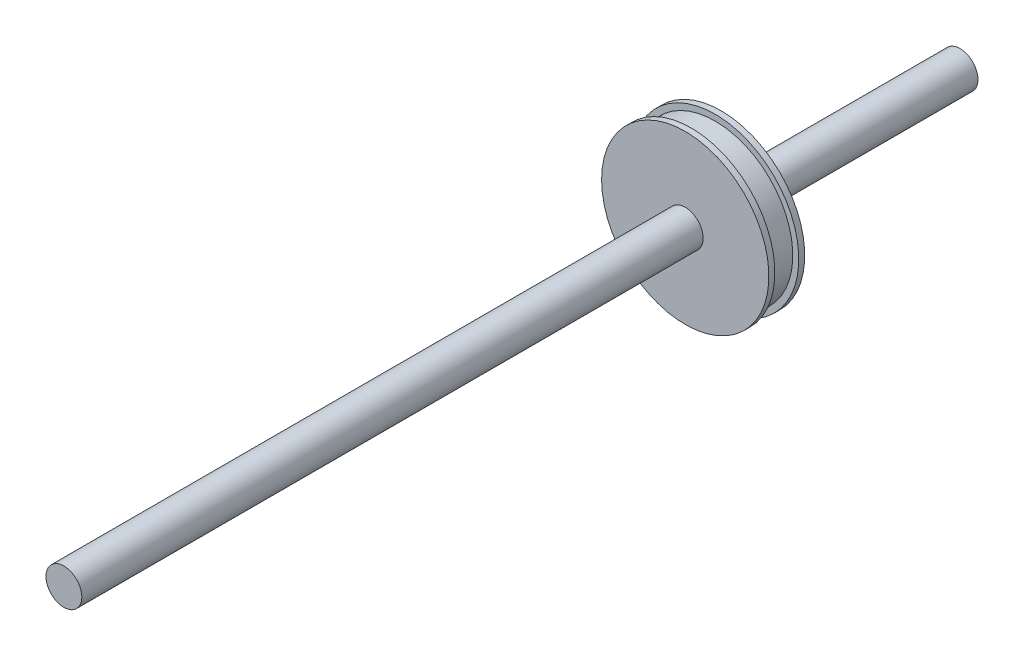
ISO-10303-21;
HEADER;
FILE_DESCRIPTION(('STEP AP214'),'2;1');
FILE_NAME('part.step','',(''),(''),'','','');
FILE_SCHEMA(('AUTOMOTIVE_DESIGN { 1 0 10303 214 1 1 1 1 }'));
ENDSEC;
DATA;
#1=APPLICATION_CONTEXT('core data for automotive mechanical design processes');
#2=APPLICATION_PROTOCOL_DEFINITION('international standard','automotive_design',2000,#1);
#3=PRODUCT_CONTEXT('',#1,'mechanical');
#4=PRODUCT('Part','Part','',(#3));
#5=PRODUCT_RELATED_PRODUCT_CATEGORY('part','',(#4));
#6=PRODUCT_DEFINITION_FORMATION('','',#4);
#7=PRODUCT_DEFINITION_CONTEXT('part definition',#1,'design');
#8=PRODUCT_DEFINITION('design','',#6,#7);
#9=PRODUCT_DEFINITION_SHAPE('','',#8);
#10=(LENGTH_UNIT() NAMED_UNIT(*) SI_UNIT(.MILLI.,.METRE.));
#11=(NAMED_UNIT(*) PLANE_ANGLE_UNIT() SI_UNIT($,.RADIAN.));
#12=(NAMED_UNIT(*) SI_UNIT($,.STERADIAN.) SOLID_ANGLE_UNIT());
#13=UNCERTAINTY_MEASURE_WITH_UNIT(LENGTH_MEASURE(1.E-05),#10,'distance_accuracy_value','');
#14=(GEOMETRIC_REPRESENTATION_CONTEXT(3) GLOBAL_UNCERTAINTY_ASSIGNED_CONTEXT((#13)) GLOBAL_UNIT_ASSIGNED_CONTEXT((#10,
#11,#12)) REPRESENTATION_CONTEXT('',''));
#15=CARTESIAN_POINT('',(0.,0.,0.));
#16=DIRECTION('',(0.,0.,1.));
#17=DIRECTION('',(1.,0.,0.));
#18=AXIS2_PLACEMENT_3D('',#15,#16,#17);
#19=CARTESIAN_POINT('',(0.,0.,23.));
#20=DIRECTION('',(0.,0.,-1.));
#21=DIRECTION('',(-1.,0.,0.));
#22=AXIS2_PLACEMENT_3D('',#19,#20,#21);
#23=PLANE('',#22);
#24=CARTESIAN_POINT('',(0.,0.,23.));
#25=DIRECTION('',(0.,0.,-1.));
#26=DIRECTION('',(-1.,0.,0.));
#27=AXIS2_PLACEMENT_3D('',#24,#25,#26);
#28=CIRCLE('',#27,7.);
#29=CARTESIAN_POINT('',(-7.,0.,23.));
#30=VERTEX_POINT('',#29);
#31=EDGE_CURVE('E11',#30,#30,#28,.T.);
#32=ORIENTED_EDGE('',*,*,#31,.F.);
#33=EDGE_LOOP('',(#32));
#34=FACE_BOUND('',#33,.T.);
#35=ADVANCED_FACE('F43',(#34),#23,.F.);
#36=CARTESIAN_POINT('',(0.,0.,20.));
#37=DIRECTION('',(0.,0.,-1.));
#38=DIRECTION('',(-1.,0.,0.));
#39=AXIS2_PLACEMENT_3D('',#36,#37,#38);
#40=CYLINDRICAL_SURFACE('',#39,7.);
#41=CARTESIAN_POINT('',(0.,0.,22.5));
#42=DIRECTION('',(0.,0.,-1.));
#43=DIRECTION('',(-1.,0.,0.));
#44=AXIS2_PLACEMENT_3D('',#41,#42,#43);
#45=CIRCLE('',#44,7.);
#46=CARTESIAN_POINT('',(-7.,0.,22.5));
#47=VERTEX_POINT('',#46);
#48=EDGE_CURVE('E49',#47,#47,#45,.T.);
#49=ORIENTED_EDGE('',*,*,#48,.F.);
#50=EDGE_LOOP('',(#49));
#51=FACE_BOUND('',#50,.T.);
#52=ORIENTED_EDGE('',*,*,#31,.T.);
#53=EDGE_LOOP('',(#52));
#54=FACE_BOUND('',#53,.T.);
#55=ADVANCED_FACE('F91',(#51,#54),#40,.T.);
#56=CARTESIAN_POINT('',(7.,0.,22.5));
#57=DIRECTION('',(0.,0.,1.));
#58=DIRECTION('',(1.,0.,0.));
#59=AXIS2_PLACEMENT_3D('',#56,#57,#58);
#60=PLANE('',#59);
#61=CARTESIAN_POINT('',(0.,0.,22.5));
#62=DIRECTION('',(0.,0.,-1.));
#63=DIRECTION('',(-1.,0.,0.));
#64=AXIS2_PLACEMENT_3D('',#61,#62,#63);
#65=CIRCLE('',#64,6.5);
#66=CARTESIAN_POINT('',(-6.5,0.,22.5));
#67=VERTEX_POINT('',#66);
#68=EDGE_CURVE('E53',#67,#67,#65,.T.);
#69=ORIENTED_EDGE('',*,*,#68,.F.);
#70=EDGE_LOOP('',(#69));
#71=FACE_BOUND('',#70,.T.);
#72=ORIENTED_EDGE('',*,*,#48,.T.);
#73=EDGE_LOOP('',(#72));
#74=FACE_BOUND('',#73,.T.);
#75=ADVANCED_FACE('F86',(#71,#74),#60,.F.);
#76=CARTESIAN_POINT('',(0.,0.,20.));
#77=DIRECTION('',(0.,0.,-1.));
#78=DIRECTION('',(-1.,0.,0.));
#79=AXIS2_PLACEMENT_3D('',#76,#77,#78);
#80=CYLINDRICAL_SURFACE('',#79,6.5);
#81=CARTESIAN_POINT('',(0.,0.,20.5));
#82=DIRECTION('',(0.,0.,-1.));
#83=DIRECTION('',(-1.,0.,0.));
#84=AXIS2_PLACEMENT_3D('',#81,#82,#83);
#85=CIRCLE('',#84,6.5);
#86=CARTESIAN_POINT('',(-6.5,0.,20.5));
#87=VERTEX_POINT('',#86);
#88=EDGE_CURVE('E57',#87,#87,#85,.T.);
#89=ORIENTED_EDGE('',*,*,#88,.F.);
#90=EDGE_LOOP('',(#89));
#91=FACE_BOUND('',#90,.T.);
#92=ORIENTED_EDGE('',*,*,#68,.T.);
#93=EDGE_LOOP('',(#92));
#94=FACE_BOUND('',#93,.T.);
#95=ADVANCED_FACE('F80',(#91,#94),#80,.T.);
#96=CARTESIAN_POINT('',(7.,0.,20.5));
#97=DIRECTION('',(0.,0.,-1.));
#98=DIRECTION('',(-1.,0.,0.));
#99=AXIS2_PLACEMENT_3D('',#96,#97,#98);
#100=PLANE('',#99);
#101=CARTESIAN_POINT('',(0.,0.,20.5));
#102=DIRECTION('',(0.,0.,-1.));
#103=DIRECTION('',(-1.,0.,0.));
#104=AXIS2_PLACEMENT_3D('',#101,#102,#103);
#105=CIRCLE('',#104,7.);
#106=CARTESIAN_POINT('',(-7.,0.,20.5));
#107=VERTEX_POINT('',#106);
#108=EDGE_CURVE('E62',#107,#107,#105,.T.);
#109=ORIENTED_EDGE('',*,*,#108,.F.);
#110=EDGE_LOOP('',(#109));
#111=FACE_BOUND('',#110,.T.);
#112=ORIENTED_EDGE('',*,*,#88,.T.);
#113=EDGE_LOOP('',(#112));
#114=FACE_BOUND('',#113,.T.);
#115=ADVANCED_FACE('F74',(#111,#114),#100,.F.);
#116=CARTESIAN_POINT('',(0.,0.,20.));
#117=DIRECTION('',(0.,0.,-1.));
#118=DIRECTION('',(-1.,0.,0.));
#119=AXIS2_PLACEMENT_3D('',#116,#117,#118);
#120=CYLINDRICAL_SURFACE('',#119,7.);
#121=CARTESIAN_POINT('',(0.,0.,20.));
#122=DIRECTION('',(0.,0.,-1.));
#123=DIRECTION('',(-1.,0.,0.));
#124=AXIS2_PLACEMENT_3D('',#121,#122,#123);
#125=CIRCLE('',#124,7.);
#126=CARTESIAN_POINT('',(-7.,0.,20.));
#127=VERTEX_POINT('',#126);
#128=EDGE_CURVE('E65',#127,#127,#125,.T.);
#129=ORIENTED_EDGE('',*,*,#128,.F.);
#130=EDGE_LOOP('',(#129));
#131=FACE_BOUND('',#130,.T.);
#132=ORIENTED_EDGE('',*,*,#108,.T.);
#133=EDGE_LOOP('',(#132));
#134=FACE_BOUND('',#133,.T.);
#135=ADVANCED_FACE('F71',(#131,#134),#120,.T.);
#136=CARTESIAN_POINT('',(0.,0.,20.));
#137=DIRECTION('',(0.,0.,1.));
#138=DIRECTION('',(1.,0.,0.));
#139=AXIS2_PLACEMENT_3D('',#136,#137,#138);
#140=PLANE('',#139);
#141=ORIENTED_EDGE('',*,*,#128,.T.);
#142=EDGE_LOOP('',(#141));
#143=FACE_BOUND('',#142,.T.);
#144=ADVANCED_FACE('F69',(#143),#140,.F.);
#145=CLOSED_SHELL('',(#35,#55,#75,#95,#115,#135,#144));
#146=MANIFOLD_SOLID_BREP('B2',#145);
#147=CARTESIAN_POINT('',(0.,0.,75.));
#148=DIRECTION('',(0.,0.,-1.));
#149=DIRECTION('',(-1.,0.,0.));
#150=AXIS2_PLACEMENT_3D('',#147,#148,#149);
#151=CYLINDRICAL_SURFACE('',#150,1.5);
#152=CARTESIAN_POINT('',(0.,0.,75.));
#153=DIRECTION('',(0.,0.,1.));
#154=DIRECTION('',(1.,0.,0.));
#155=AXIS2_PLACEMENT_3D('',#152,#153,#154);
#156=CIRCLE('',#155,1.5);
#157=CARTESIAN_POINT('',(1.5,0.,75.));
#158=VERTEX_POINT('',#157);
#159=EDGE_CURVE('E42',#158,#158,#156,.T.);
#160=ORIENTED_EDGE('',*,*,#159,.F.);
#161=EDGE_LOOP('',(#160));
#162=FACE_BOUND('',#161,.T.);
#163=CARTESIAN_POINT('',(0.,0.,0.));
#164=DIRECTION('',(0.,0.,1.));
#165=DIRECTION('',(1.,0.,0.));
#166=AXIS2_PLACEMENT_3D('',#163,#164,#165);
#167=CIRCLE('',#166,1.5);
#168=CARTESIAN_POINT('',(1.5,0.,0.));
#169=VERTEX_POINT('',#168);
#170=EDGE_CURVE('E147',#169,#169,#167,.T.);
#171=ORIENTED_EDGE('',*,*,#170,.T.);
#172=EDGE_LOOP('',(#171));
#173=FACE_BOUND('',#172,.T.);
#174=ADVANCED_FACE('F144',(#162,#173),#151,.T.);
#175=CARTESIAN_POINT('',(0.,0.,75.));
#176=DIRECTION('',(0.,0.,1.));
#177=DIRECTION('',(1.,0.,0.));
#178=AXIS2_PLACEMENT_3D('',#175,#176,#177);
#179=PLANE('',#178);
#180=ORIENTED_EDGE('',*,*,#159,.T.);
#181=EDGE_LOOP('',(#180));
#182=FACE_BOUND('',#181,.T.);
#183=ADVANCED_FACE('F159',(#182),#179,.T.);
#184=CARTESIAN_POINT('',(0.,0.,0.));
#185=DIRECTION('',(0.,0.,1.));
#186=DIRECTION('',(1.,0.,0.));
#187=AXIS2_PLACEMENT_3D('',#184,#185,#186);
#188=PLANE('',#187);
#189=ORIENTED_EDGE('',*,*,#170,.F.);
#190=EDGE_LOOP('',(#189));
#191=FACE_BOUND('',#190,.T.);
#192=ADVANCED_FACE('F157',(#191),#188,.F.);
#193=CLOSED_SHELL('',(#174,#183,#192));
#194=MANIFOLD_SOLID_BREP('B6',#193);
#195=ADVANCED_BREP_SHAPE_REPRESENTATION('',(#18,#146,#194),#14);
#196=SHAPE_DEFINITION_REPRESENTATION(#9,#195);
ENDSEC;
END-ISO-10303-21;
